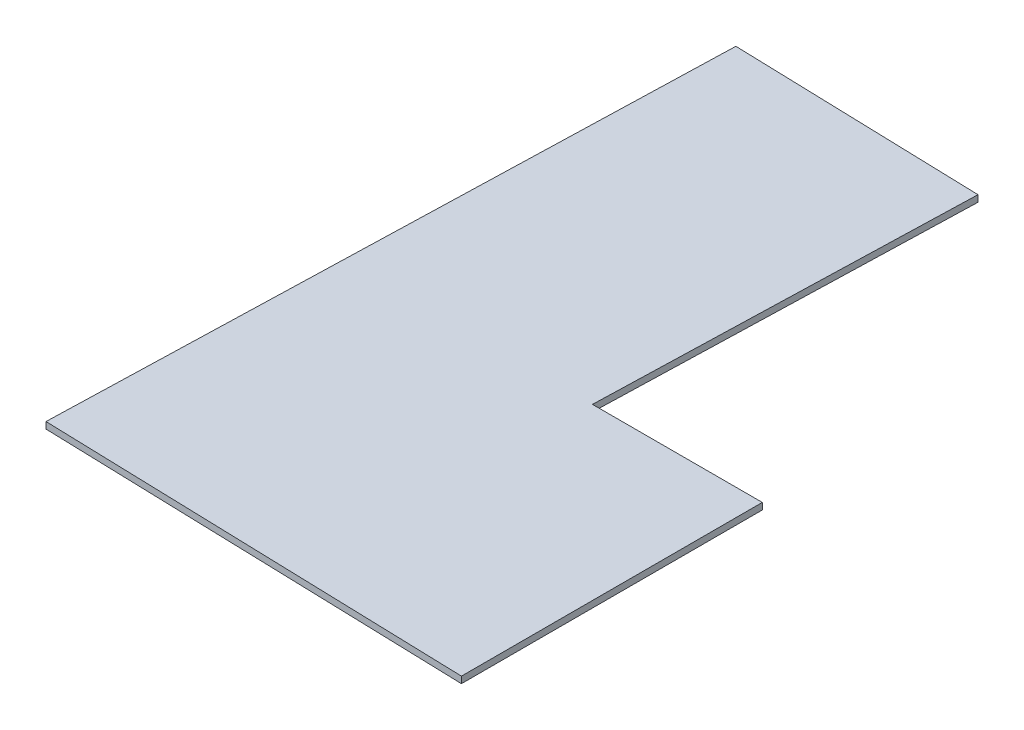
ISO-10303-21;
HEADER;
FILE_DESCRIPTION(('STEP AP214'),'2;1');
FILE_NAME('part.step','',(''),(''),'','','');
FILE_SCHEMA(('AUTOMOTIVE_DESIGN { 1 0 10303 214 1 1 1 1 }'));
ENDSEC;
DATA;
#1=APPLICATION_CONTEXT('core data for automotive mechanical design processes');
#2=APPLICATION_PROTOCOL_DEFINITION('international standard','automotive_design',2000,#1);
#3=PRODUCT_CONTEXT('',#1,'mechanical');
#4=PRODUCT('Part','Part','',(#3));
#5=PRODUCT_RELATED_PRODUCT_CATEGORY('part','',(#4));
#6=PRODUCT_DEFINITION_FORMATION('','',#4);
#7=PRODUCT_DEFINITION_CONTEXT('part definition',#1,'design');
#8=PRODUCT_DEFINITION('design','',#6,#7);
#9=PRODUCT_DEFINITION_SHAPE('','',#8);
#10=(LENGTH_UNIT() NAMED_UNIT(*) SI_UNIT(.MILLI.,.METRE.));
#11=(NAMED_UNIT(*) PLANE_ANGLE_UNIT() SI_UNIT($,.RADIAN.));
#12=(NAMED_UNIT(*) SI_UNIT($,.STERADIAN.) SOLID_ANGLE_UNIT());
#13=UNCERTAINTY_MEASURE_WITH_UNIT(LENGTH_MEASURE(1.E-05),#10,'distance_accuracy_value','');
#14=(GEOMETRIC_REPRESENTATION_CONTEXT(3) GLOBAL_UNCERTAINTY_ASSIGNED_CONTEXT((#13)) GLOBAL_UNIT_ASSIGNED_CONTEXT((#10,
#11,#12)) REPRESENTATION_CONTEXT('',''));
#15=CARTESIAN_POINT('',(0.,0.,0.));
#16=DIRECTION('',(0.,0.,1.));
#17=DIRECTION('',(1.,0.,0.));
#18=AXIS2_PLACEMENT_3D('',#15,#16,#17);
#19=CARTESIAN_POINT('',(-366.023594878668,3.175,340.203949897284));
#20=DIRECTION('',(-0.999555640093852,0.,-0.029808092132341));
#21=DIRECTION('',(-0.029808092132341,0.,0.999555640093852));
#22=AXIS2_PLACEMENT_3D('',#19,#20,#21);
#23=PLANE('',#22);
#24=DIRECTION('',(0.029808092132341,0.,-0.999555640093852));
#25=VECTOR('',#24,1.);
#26=CARTESIAN_POINT('',(-366.023594878668,0.,340.203949897284));
#27=LINE('',#26,#25);
#28=CARTESIAN_POINT('',(-366.023594878668,0.,340.203949897284));
#29=VERTEX_POINT('',#28);
#30=CARTESIAN_POINT('',(-356.36595277267,0.,16.3539498972842));
#31=VERTEX_POINT('',#30);
#32=EDGE_CURVE('E120',#29,#31,#27,.T.);
#33=ORIENTED_EDGE('',*,*,#32,.F.);
#34=DIRECTION('',(0.,-1.,0.));
#35=VECTOR('',#34,1.);
#36=CARTESIAN_POINT('',(-366.023594878668,3.175,340.203949897284));
#37=LINE('',#36,#35);
#38=CARTESIAN_POINT('',(-366.023594878668,3.175,340.203949897284));
#39=VERTEX_POINT('',#38);
#40=EDGE_CURVE('E11',#39,#29,#37,.T.);
#41=ORIENTED_EDGE('',*,*,#40,.F.);
#42=DIRECTION('',(0.029808092132341,0.,-0.999555640093852));
#43=VECTOR('',#42,1.);
#44=CARTESIAN_POINT('',(-366.023594878668,3.175,340.203949897284));
#45=LINE('',#44,#43);
#46=CARTESIAN_POINT('',(-356.36595277267,3.175,16.3539498972842));
#47=VERTEX_POINT('',#46);
#48=EDGE_CURVE('E134',#39,#47,#45,.T.);
#49=ORIENTED_EDGE('',*,*,#48,.T.);
#50=DIRECTION('',(0.,-1.,0.));
#51=VECTOR('',#50,1.);
#52=CARTESIAN_POINT('',(-356.36595277267,3.175,16.3539498972842));
#53=LINE('',#52,#51);
#54=EDGE_CURVE('E38',#47,#31,#53,.T.);
#55=ORIENTED_EDGE('',*,*,#54,.T.);
#56=EDGE_LOOP('',(#33,#41,#49,#55));
#57=FACE_BOUND('',#56,.T.);
#58=ADVANCED_FACE('F35',(#57),#23,.T.);
#59=CARTESIAN_POINT('',(-159.013594878668,3.175,346.377266223863));
#60=DIRECTION('',(-0.0298080921323405,0.,0.999555640093852));
#61=DIRECTION('',(0.999555640093852,0.,0.0298080921323405));
#62=AXIS2_PLACEMENT_3D('',#59,#60,#61);
#63=PLANE('',#62);
#64=DIRECTION('',(-0.999555640093852,0.,-0.0298080921323405));
#65=VECTOR('',#64,1.);
#66=CARTESIAN_POINT('',(-159.013594878668,0.,346.377266223863));
#67=LINE('',#66,#65);
#68=CARTESIAN_POINT('',(-159.013594878668,0.,346.377266223863));
#69=VERTEX_POINT('',#68);
#70=EDGE_CURVE('E132',#69,#29,#67,.T.);
#71=ORIENTED_EDGE('',*,*,#70,.F.);
#72=DIRECTION('',(0.,-1.,0.));
#73=VECTOR('',#72,1.);
#74=CARTESIAN_POINT('',(-159.013594878668,3.175,346.377266223863));
#75=LINE('',#74,#73);
#76=CARTESIAN_POINT('',(-159.013594878668,3.175,346.377266223863));
#77=VERTEX_POINT('',#76);
#78=EDGE_CURVE('E44',#77,#69,#75,.T.);
#79=ORIENTED_EDGE('',*,*,#78,.F.);
#80=DIRECTION('',(-0.999555640093852,0.,-0.0298080921323405));
#81=VECTOR('',#80,1.);
#82=CARTESIAN_POINT('',(-159.013594878668,3.175,346.377266223863));
#83=LINE('',#82,#81);
#84=EDGE_CURVE('E110',#77,#39,#83,.T.);
#85=ORIENTED_EDGE('',*,*,#84,.T.);
#86=ORIENTED_EDGE('',*,*,#40,.T.);
#87=EDGE_LOOP('',(#71,#79,#85,#86));
#88=FACE_BOUND('',#87,.T.);
#89=ADVANCED_FACE('F142',(#88),#63,.T.);
#90=CARTESIAN_POINT('',(-159.013594878668,3.175,200.926894995597));
#91=DIRECTION('',(1.,0.,0.));
#92=DIRECTION('',(0.,0.,-1.));
#93=AXIS2_PLACEMENT_3D('',#90,#91,#92);
#94=PLANE('',#93);
#95=DIRECTION('',(0.,0.,1.));
#96=VECTOR('',#95,1.);
#97=CARTESIAN_POINT('',(-159.013594878668,0.,200.926894995597));
#98=LINE('',#97,#96);
#99=CARTESIAN_POINT('',(-159.013594878668,0.,200.926894995597));
#100=VERTEX_POINT('',#99);
#101=EDGE_CURVE('E97',#100,#69,#98,.T.);
#102=ORIENTED_EDGE('',*,*,#101,.F.);
#103=DIRECTION('',(0.,-1.,0.));
#104=VECTOR('',#103,1.);
#105=CARTESIAN_POINT('',(-159.013594878668,3.175,200.926894995597));
#106=LINE('',#105,#104);
#107=CARTESIAN_POINT('',(-159.013594878668,3.175,200.926894995597));
#108=VERTEX_POINT('',#107);
#109=EDGE_CURVE('E92',#108,#100,#106,.T.);
#110=ORIENTED_EDGE('',*,*,#109,.F.);
#111=DIRECTION('',(0.,0.,1.));
#112=VECTOR('',#111,1.);
#113=CARTESIAN_POINT('',(-159.013594878668,3.175,200.926894995597));
#114=LINE('',#113,#112);
#115=EDGE_CURVE('E95',#108,#77,#114,.T.);
#116=ORIENTED_EDGE('',*,*,#115,.T.);
#117=ORIENTED_EDGE('',*,*,#78,.T.);
#118=EDGE_LOOP('',(#102,#110,#116,#117));
#119=FACE_BOUND('',#118,.T.);
#120=ADVANCED_FACE('F94',(#119),#94,.T.);
#121=CARTESIAN_POINT('',(-241.112870420139,3.175,200.926894995597));
#122=DIRECTION('',(0.,0.,-1.));
#123=DIRECTION('',(-1.,0.,0.));
#124=AXIS2_PLACEMENT_3D('',#121,#122,#123);
#125=PLANE('',#124);
#126=DIRECTION('',(1.,0.,0.));
#127=VECTOR('',#126,1.);
#128=CARTESIAN_POINT('',(-241.112870420139,0.,200.926894995597));
#129=LINE('',#128,#127);
#130=CARTESIAN_POINT('',(-241.112870420139,0.,200.926894995597));
#131=VERTEX_POINT('',#130);
#132=EDGE_CURVE('E129',#131,#100,#129,.T.);
#133=ORIENTED_EDGE('',*,*,#132,.F.);
#134=DIRECTION('',(0.,-1.,0.));
#135=VECTOR('',#134,1.);
#136=CARTESIAN_POINT('',(-241.112870420139,3.175,200.926894995597));
#137=LINE('',#136,#135);
#138=CARTESIAN_POINT('',(-241.112870420139,3.175,200.926894995597));
#139=VERTEX_POINT('',#138);
#140=EDGE_CURVE('E102',#139,#131,#137,.T.);
#141=ORIENTED_EDGE('',*,*,#140,.F.);
#142=DIRECTION('',(1.,0.,0.));
#143=VECTOR('',#142,1.);
#144=CARTESIAN_POINT('',(-241.112870420139,3.175,200.926894995597));
#145=LINE('',#144,#143);
#146=EDGE_CURVE('E108',#139,#108,#145,.T.);
#147=ORIENTED_EDGE('',*,*,#146,.T.);
#148=ORIENTED_EDGE('',*,*,#109,.T.);
#149=EDGE_LOOP('',(#133,#141,#147,#148));
#150=FACE_BOUND('',#149,.T.);
#151=ADVANCED_FACE('F112',(#150),#125,.T.);
#152=CARTESIAN_POINT('',(-235.71595277267,3.175,19.9518949955973));
#153=DIRECTION('',(0.999555640093852,0.,0.0298080921323408));
#154=DIRECTION('',(0.0298080921323408,0.,-0.999555640093852));
#155=AXIS2_PLACEMENT_3D('',#152,#153,#154);
#156=PLANE('',#155);
#157=DIRECTION('',(-0.0298080921323408,0.,0.999555640093852));
#158=VECTOR('',#157,1.);
#159=CARTESIAN_POINT('',(-235.71595277267,0.,19.9518949955973));
#160=LINE('',#159,#158);
#161=CARTESIAN_POINT('',(-235.71595277267,0.,19.9518949955973));
#162=VERTEX_POINT('',#161);
#163=EDGE_CURVE('E126',#162,#131,#160,.T.);
#164=ORIENTED_EDGE('',*,*,#163,.F.);
#165=DIRECTION('',(0.,-1.,0.));
#166=VECTOR('',#165,1.);
#167=CARTESIAN_POINT('',(-235.71595277267,3.175,19.9518949955973));
#168=LINE('',#167,#166);
#169=CARTESIAN_POINT('',(-235.71595277267,3.175,19.9518949955973));
#170=VERTEX_POINT('',#169);
#171=EDGE_CURVE('E137',#170,#162,#168,.T.);
#172=ORIENTED_EDGE('',*,*,#171,.F.);
#173=DIRECTION('',(-0.0298080921323408,0.,0.999555640093852));
#174=VECTOR('',#173,1.);
#175=CARTESIAN_POINT('',(-235.71595277267,3.175,19.9518949955973));
#176=LINE('',#175,#174);
#177=EDGE_CURVE('E113',#170,#139,#176,.T.);
#178=ORIENTED_EDGE('',*,*,#177,.T.);
#179=ORIENTED_EDGE('',*,*,#140,.T.);
#180=EDGE_LOOP('',(#164,#172,#178,#179));
#181=FACE_BOUND('',#180,.T.);
#182=ADVANCED_FACE('F155',(#181),#156,.T.);
#183=CARTESIAN_POINT('',(-356.36595277267,3.175,16.3539498972842));
#184=DIRECTION('',(0.0298080921323409,0.,-0.999555640093852));
#185=DIRECTION('',(-0.999555640093852,0.,-0.0298080921323409));
#186=AXIS2_PLACEMENT_3D('',#183,#184,#185);
#187=PLANE('',#186);
#188=DIRECTION('',(0.999555640093852,0.,0.0298080921323409));
#189=VECTOR('',#188,1.);
#190=CARTESIAN_POINT('',(-356.36595277267,0.,16.3539498972842));
#191=LINE('',#190,#189);
#192=EDGE_CURVE('E123',#31,#162,#191,.T.);
#193=ORIENTED_EDGE('',*,*,#192,.F.);
#194=ORIENTED_EDGE('',*,*,#54,.F.);
#195=DIRECTION('',(0.999555640093852,0.,0.0298080921323409));
#196=VECTOR('',#195,1.);
#197=CARTESIAN_POINT('',(-356.36595277267,3.175,16.3539498972842));
#198=LINE('',#197,#196);
#199=EDGE_CURVE('E115',#47,#170,#198,.T.);
#200=ORIENTED_EDGE('',*,*,#199,.T.);
#201=ORIENTED_EDGE('',*,*,#171,.T.);
#202=EDGE_LOOP('',(#193,#194,#200,#201));
#203=FACE_BOUND('',#202,.T.);
#204=ADVANCED_FACE('F139',(#203),#187,.T.);
#205=CARTESIAN_POINT('',(0.,3.175,0.));
#206=DIRECTION('',(0.,-1.,0.));
#207=DIRECTION('',(0.,0.,-1.));
#208=AXIS2_PLACEMENT_3D('',#205,#206,#207);
#209=PLANE('',#208);
#210=ORIENTED_EDGE('',*,*,#48,.F.);
#211=ORIENTED_EDGE('',*,*,#84,.F.);
#212=ORIENTED_EDGE('',*,*,#115,.F.);
#213=ORIENTED_EDGE('',*,*,#146,.F.);
#214=ORIENTED_EDGE('',*,*,#177,.F.);
#215=ORIENTED_EDGE('',*,*,#199,.F.);
#216=EDGE_LOOP('',(#210,#211,#212,#213,#214,#215));
#217=FACE_BOUND('',#216,.T.);
#218=ADVANCED_FACE('F106',(#217),#209,.F.);
#219=CARTESIAN_POINT('',(0.,0.,0.));
#220=DIRECTION('',(0.,-1.,0.));
#221=DIRECTION('',(0.,0.,-1.));
#222=AXIS2_PLACEMENT_3D('',#219,#220,#221);
#223=PLANE('',#222);
#224=ORIENTED_EDGE('',*,*,#32,.T.);
#225=ORIENTED_EDGE('',*,*,#192,.T.);
#226=ORIENTED_EDGE('',*,*,#163,.T.);
#227=ORIENTED_EDGE('',*,*,#132,.T.);
#228=ORIENTED_EDGE('',*,*,#101,.T.);
#229=ORIENTED_EDGE('',*,*,#70,.T.);
#230=EDGE_LOOP('',(#224,#225,#226,#227,#228,#229));
#231=FACE_BOUND('',#230,.T.);
#232=ADVANCED_FACE('F141',(#231),#223,.T.);
#233=CLOSED_SHELL('',(#58,#89,#120,#151,#182,#204,#218,#232));
#234=MANIFOLD_SOLID_BREP('B2',#233);
#235=ADVANCED_BREP_SHAPE_REPRESENTATION('',(#18,#234),#14);
#236=SHAPE_DEFINITION_REPRESENTATION(#9,#235);
ENDSEC;
END-ISO-10303-21;
